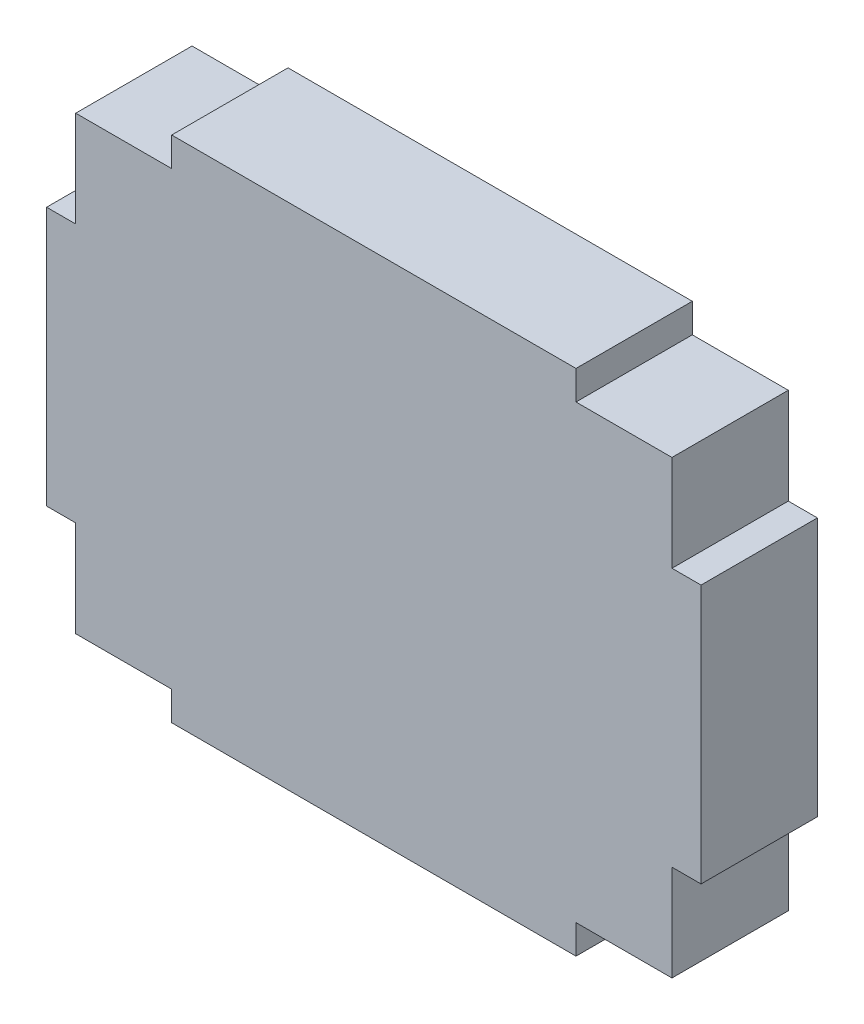
ISO-10303-21;
HEADER;
FILE_DESCRIPTION(('STEP AP214'),'2;1');
FILE_NAME('part.step','',(''),(''),'','','');
FILE_SCHEMA(('AUTOMOTIVE_DESIGN { 1 0 10303 214 1 1 1 1 }'));
ENDSEC;
DATA;
#1=APPLICATION_CONTEXT('core data for automotive mechanical design processes');
#2=APPLICATION_PROTOCOL_DEFINITION('international standard','automotive_design',2000,#1);
#3=PRODUCT_CONTEXT('',#1,'mechanical');
#4=PRODUCT('Part','Part','',(#3));
#5=PRODUCT_RELATED_PRODUCT_CATEGORY('part','',(#4));
#6=PRODUCT_DEFINITION_FORMATION('','',#4);
#7=PRODUCT_DEFINITION_CONTEXT('part definition',#1,'design');
#8=PRODUCT_DEFINITION('design','',#6,#7);
#9=PRODUCT_DEFINITION_SHAPE('','',#8);
#10=(LENGTH_UNIT() NAMED_UNIT(*) SI_UNIT(.MILLI.,.METRE.));
#11=(NAMED_UNIT(*) PLANE_ANGLE_UNIT() SI_UNIT($,.RADIAN.));
#12=(NAMED_UNIT(*) SI_UNIT($,.STERADIAN.) SOLID_ANGLE_UNIT());
#13=UNCERTAINTY_MEASURE_WITH_UNIT(LENGTH_MEASURE(1.E-05),#10,'distance_accuracy_value','');
#14=(GEOMETRIC_REPRESENTATION_CONTEXT(3) GLOBAL_UNCERTAINTY_ASSIGNED_CONTEXT((#13)) GLOBAL_UNIT_ASSIGNED_CONTEXT((#10,
#11,#12)) REPRESENTATION_CONTEXT('',''));
#15=CARTESIAN_POINT('',(0.,0.,0.));
#16=DIRECTION('',(0.,0.,1.));
#17=DIRECTION('',(1.,0.,0.));
#18=AXIS2_PLACEMENT_3D('',#15,#16,#17);
#19=CARTESIAN_POINT('',(0.,0.,0.8));
#20=DIRECTION('',(0.,0.,1.));
#21=DIRECTION('',(1.,0.,0.));
#22=AXIS2_PLACEMENT_3D('',#19,#20,#21);
#23=PLANE('',#22);
#24=DIRECTION('',(0.,1.,0.));
#25=VECTOR('',#24,1.);
#26=CARTESIAN_POINT('',(-1.39,0.,0.8));
#27=LINE('',#26,#25);
#28=CARTESIAN_POINT('',(-1.39,-1.55,0.8));
#29=VERTEX_POINT('',#28);
#30=CARTESIAN_POINT('',(-1.39,-1.75,0.8));
#31=VERTEX_POINT('',#30);
#32=EDGE_CURVE('E190',#29,#31,#27,.F.);
#33=ORIENTED_EDGE('',*,*,#32,.T.);
#34=DIRECTION('',(1.,0.,0.));
#35=VECTOR('',#34,1.);
#36=CARTESIAN_POINT('',(1.11,-1.75,0.8));
#37=LINE('',#36,#35);
#38=CARTESIAN_POINT('',(1.39,-1.75,0.8));
#39=VERTEX_POINT('',#38);
#40=EDGE_CURVE('E192',#39,#31,#37,.F.);
#41=ORIENTED_EDGE('',*,*,#40,.F.);
#42=DIRECTION('',(0.,1.,0.));
#43=VECTOR('',#42,1.);
#44=CARTESIAN_POINT('',(1.39,-1.75,0.8));
#45=LINE('',#44,#43);
#46=CARTESIAN_POINT('',(1.39,-1.55,0.8));
#47=VERTEX_POINT('',#46);
#48=EDGE_CURVE('E194',#47,#39,#45,.F.);
#49=ORIENTED_EDGE('',*,*,#48,.F.);
#50=DIRECTION('',(1.,0.,0.));
#51=VECTOR('',#50,1.);
#52=CARTESIAN_POINT('',(1.39,-1.55,0.8));
#53=LINE('',#52,#51);
#54=CARTESIAN_POINT('',(2.05,-1.55,0.8));
#55=VERTEX_POINT('',#54);
#56=EDGE_CURVE('E199',#55,#47,#53,.F.);
#57=ORIENTED_EDGE('',*,*,#56,.F.);
#58=DIRECTION('',(0.,1.,0.));
#59=VECTOR('',#58,1.);
#60=CARTESIAN_POINT('',(2.05,-1.55,0.8));
#61=LINE('',#60,#59);
#62=CARTESIAN_POINT('',(2.05,-0.89,0.8));
#63=VERTEX_POINT('',#62);
#64=EDGE_CURVE('E203',#63,#55,#61,.F.);
#65=ORIENTED_EDGE('',*,*,#64,.F.);
#66=DIRECTION('',(1.,0.,0.));
#67=VECTOR('',#66,1.);
#68=CARTESIAN_POINT('',(2.05,-0.89,0.8));
#69=LINE('',#68,#67);
#70=CARTESIAN_POINT('',(2.25,-0.89,0.8));
#71=VERTEX_POINT('',#70);
#72=EDGE_CURVE('E207',#71,#63,#69,.F.);
#73=ORIENTED_EDGE('',*,*,#72,.F.);
#74=DIRECTION('',(0.,1.,0.));
#75=VECTOR('',#74,1.);
#76=CARTESIAN_POINT('',(2.25,0.61,0.8));
#77=LINE('',#76,#75);
#78=CARTESIAN_POINT('',(2.25,0.89,0.8));
#79=VERTEX_POINT('',#78);
#80=EDGE_CURVE('E213',#79,#71,#77,.F.);
#81=ORIENTED_EDGE('',*,*,#80,.F.);
#82=DIRECTION('',(1.,0.,0.));
#83=VECTOR('',#82,1.);
#84=CARTESIAN_POINT('',(2.25,0.89,0.8));
#85=LINE('',#84,#83);
#86=CARTESIAN_POINT('',(2.05,0.89,0.8));
#87=VERTEX_POINT('',#86);
#88=EDGE_CURVE('E215',#87,#79,#85,.T.);
#89=ORIENTED_EDGE('',*,*,#88,.F.);
#90=DIRECTION('',(0.,1.,0.));
#91=VECTOR('',#90,1.);
#92=CARTESIAN_POINT('',(2.05,0.89,0.8));
#93=LINE('',#92,#91);
#94=CARTESIAN_POINT('',(2.05,1.55,0.8));
#95=VERTEX_POINT('',#94);
#96=EDGE_CURVE('E220',#95,#87,#93,.F.);
#97=ORIENTED_EDGE('',*,*,#96,.F.);
#98=DIRECTION('',(1.,0.,0.));
#99=VECTOR('',#98,1.);
#100=CARTESIAN_POINT('',(2.05,1.55,0.8));
#101=LINE('',#100,#99);
#102=CARTESIAN_POINT('',(1.39,1.55,0.8));
#103=VERTEX_POINT('',#102);
#104=EDGE_CURVE('E224',#103,#95,#101,.T.);
#105=ORIENTED_EDGE('',*,*,#104,.F.);
#106=DIRECTION('',(0.,1.,0.));
#107=VECTOR('',#106,1.);
#108=CARTESIAN_POINT('',(1.39,1.55,0.8));
#109=LINE('',#108,#107);
#110=CARTESIAN_POINT('',(1.39,1.75,0.8));
#111=VERTEX_POINT('',#110);
#112=EDGE_CURVE('E157',#111,#103,#109,.F.);
#113=ORIENTED_EDGE('',*,*,#112,.F.);
#114=DIRECTION('',(1.,0.,0.));
#115=VECTOR('',#114,1.);
#116=CARTESIAN_POINT('',(1.11,1.75,0.8));
#117=LINE('',#116,#115);
#118=CARTESIAN_POINT('',(-1.39,1.75,0.8));
#119=VERTEX_POINT('',#118);
#120=EDGE_CURVE('E153',#119,#111,#117,.T.);
#121=ORIENTED_EDGE('',*,*,#120,.F.);
#122=DIRECTION('',(0.,1.,0.));
#123=VECTOR('',#122,1.);
#124=CARTESIAN_POINT('',(-1.39,0.,0.8));
#125=LINE('',#124,#123);
#126=CARTESIAN_POINT('',(-1.39,1.55,0.8));
#127=VERTEX_POINT('',#126);
#128=EDGE_CURVE('E20',#119,#127,#125,.F.);
#129=ORIENTED_EDGE('',*,*,#128,.T.);
#130=DIRECTION('',(1.,0.,0.));
#131=VECTOR('',#130,1.);
#132=CARTESIAN_POINT('',(0.,1.55,0.8));
#133=LINE('',#132,#131);
#134=CARTESIAN_POINT('',(-2.05,1.55,0.8));
#135=VERTEX_POINT('',#134);
#136=EDGE_CURVE('E174',#127,#135,#133,.F.);
#137=ORIENTED_EDGE('',*,*,#136,.T.);
#138=DIRECTION('',(0.,1.,0.));
#139=VECTOR('',#138,1.);
#140=CARTESIAN_POINT('',(-2.05,0.,0.8));
#141=LINE('',#140,#139);
#142=CARTESIAN_POINT('',(-2.05,0.89,0.8));
#143=VERTEX_POINT('',#142);
#144=EDGE_CURVE('E175',#135,#143,#141,.F.);
#145=ORIENTED_EDGE('',*,*,#144,.T.);
#146=DIRECTION('',(1.,0.,0.));
#147=VECTOR('',#146,1.);
#148=CARTESIAN_POINT('',(0.,0.89,0.8));
#149=LINE('',#148,#147);
#150=CARTESIAN_POINT('',(-2.25,0.89,0.8));
#151=VERTEX_POINT('',#150);
#152=EDGE_CURVE('E177',#143,#151,#149,.F.);
#153=ORIENTED_EDGE('',*,*,#152,.T.);
#154=DIRECTION('',(0.,1.,0.));
#155=VECTOR('',#154,1.);
#156=CARTESIAN_POINT('',(-2.25,0.,0.8));
#157=LINE('',#156,#155);
#158=CARTESIAN_POINT('',(-2.25,-0.89,0.8));
#159=VERTEX_POINT('',#158);
#160=EDGE_CURVE('E182',#151,#159,#157,.F.);
#161=ORIENTED_EDGE('',*,*,#160,.T.);
#162=DIRECTION('',(1.,0.,0.));
#163=VECTOR('',#162,1.);
#164=CARTESIAN_POINT('',(0.,-0.89,0.8));
#165=LINE('',#164,#163);
#166=CARTESIAN_POINT('',(-2.05,-0.89,0.8));
#167=VERTEX_POINT('',#166);
#168=EDGE_CURVE('E184',#159,#167,#165,.T.);
#169=ORIENTED_EDGE('',*,*,#168,.T.);
#170=DIRECTION('',(0.,1.,0.));
#171=VECTOR('',#170,1.);
#172=CARTESIAN_POINT('',(-2.05,0.,0.8));
#173=LINE('',#172,#171);
#174=CARTESIAN_POINT('',(-2.05,-1.55,0.8));
#175=VERTEX_POINT('',#174);
#176=EDGE_CURVE('E186',#167,#175,#173,.F.);
#177=ORIENTED_EDGE('',*,*,#176,.T.);
#178=DIRECTION('',(1.,0.,0.));
#179=VECTOR('',#178,1.);
#180=CARTESIAN_POINT('',(0.,-1.55,0.8));
#181=LINE('',#180,#179);
#182=EDGE_CURVE('E188',#175,#29,#181,.T.);
#183=ORIENTED_EDGE('',*,*,#182,.T.);
#184=EDGE_LOOP('',(#33,#41,#49,#57,#65,#73,#81,#89,#97,#105,#113,#121,#129,#137,#145,#153,#161,
#169,#177,#183));
#185=FACE_BOUND('',#184,.T.);
#186=ADVANCED_FACE('F17',(#185),#23,.T.);
#187=CARTESIAN_POINT('',(1.11,-1.75,0.));
#188=DIRECTION('',(0.,-1.,0.));
#189=DIRECTION('',(0.,0.,-1.));
#190=AXIS2_PLACEMENT_3D('',#187,#188,#189);
#191=PLANE('',#190);
#192=ORIENTED_EDGE('',*,*,#40,.T.);
#193=DIRECTION('',(0.,0.,1.));
#194=VECTOR('',#193,1.);
#195=CARTESIAN_POINT('',(-1.39,-1.75,0.));
#196=LINE('',#195,#194);
#197=CARTESIAN_POINT('',(-1.39,-1.75,0.));
#198=VERTEX_POINT('',#197);
#199=EDGE_CURVE('E246',#198,#31,#196,.T.);
#200=ORIENTED_EDGE('',*,*,#199,.F.);
#201=DIRECTION('',(1.,0.,0.));
#202=VECTOR('',#201,1.);
#203=CARTESIAN_POINT('',(0.,-1.75,0.));
#204=LINE('',#203,#202);
#205=CARTESIAN_POINT('',(1.39,-1.75,0.));
#206=VERTEX_POINT('',#205);
#207=EDGE_CURVE('E250',#198,#206,#204,.T.);
#208=ORIENTED_EDGE('',*,*,#207,.T.);
#209=DIRECTION('',(0.,0.,-1.));
#210=VECTOR('',#209,1.);
#211=CARTESIAN_POINT('',(1.39,-1.75,0.));
#212=LINE('',#211,#210);
#213=EDGE_CURVE('E196',#39,#206,#212,.T.);
#214=ORIENTED_EDGE('',*,*,#213,.F.);
#215=EDGE_LOOP('',(#192,#200,#208,#214));
#216=FACE_BOUND('',#215,.T.);
#217=ADVANCED_FACE('F506',(#216),#191,.T.);
#218=CARTESIAN_POINT('',(1.39,-1.75,0.));
#219=DIRECTION('',(1.,0.,0.));
#220=DIRECTION('',(0.,0.,-1.));
#221=AXIS2_PLACEMENT_3D('',#218,#219,#220);
#222=PLANE('',#221);
#223=ORIENTED_EDGE('',*,*,#213,.T.);
#224=DIRECTION('',(0.,1.,0.));
#225=VECTOR('',#224,1.);
#226=CARTESIAN_POINT('',(1.39,0.,0.));
#227=LINE('',#226,#225);
#228=CARTESIAN_POINT('',(1.39,-1.55,0.));
#229=VERTEX_POINT('',#228);
#230=EDGE_CURVE('E252',#206,#229,#227,.T.);
#231=ORIENTED_EDGE('',*,*,#230,.T.);
#232=DIRECTION('',(0.,0.,-1.));
#233=VECTOR('',#232,1.);
#234=CARTESIAN_POINT('',(1.39,-1.55,0.));
#235=LINE('',#234,#233);
#236=EDGE_CURVE('E201',#47,#229,#235,.T.);
#237=ORIENTED_EDGE('',*,*,#236,.F.);
#238=ORIENTED_EDGE('',*,*,#48,.T.);
#239=EDGE_LOOP('',(#223,#231,#237,#238));
#240=FACE_BOUND('',#239,.T.);
#241=ADVANCED_FACE('F497',(#240),#222,.T.);
#242=CARTESIAN_POINT('',(1.39,-1.55,0.));
#243=DIRECTION('',(0.,-1.,0.));
#244=DIRECTION('',(0.,0.,-1.));
#245=AXIS2_PLACEMENT_3D('',#242,#243,#244);
#246=PLANE('',#245);
#247=ORIENTED_EDGE('',*,*,#236,.T.);
#248=DIRECTION('',(1.,0.,0.));
#249=VECTOR('',#248,1.);
#250=CARTESIAN_POINT('',(0.,-1.55,0.));
#251=LINE('',#250,#249);
#252=CARTESIAN_POINT('',(2.05,-1.55,0.));
#253=VERTEX_POINT('',#252);
#254=EDGE_CURVE('E255',#229,#253,#251,.T.);
#255=ORIENTED_EDGE('',*,*,#254,.T.);
#256=DIRECTION('',(0.,0.,-1.));
#257=VECTOR('',#256,1.);
#258=CARTESIAN_POINT('',(2.05,-1.55,0.));
#259=LINE('',#258,#257);
#260=EDGE_CURVE('E205',#55,#253,#259,.T.);
#261=ORIENTED_EDGE('',*,*,#260,.F.);
#262=ORIENTED_EDGE('',*,*,#56,.T.);
#263=EDGE_LOOP('',(#247,#255,#261,#262));
#264=FACE_BOUND('',#263,.T.);
#265=ADVANCED_FACE('F488',(#264),#246,.T.);
#266=CARTESIAN_POINT('',(2.05,-1.55,0.));
#267=DIRECTION('',(1.,0.,0.));
#268=DIRECTION('',(0.,0.,-1.));
#269=AXIS2_PLACEMENT_3D('',#266,#267,#268);
#270=PLANE('',#269);
#271=ORIENTED_EDGE('',*,*,#260,.T.);
#272=DIRECTION('',(0.,1.,0.));
#273=VECTOR('',#272,1.);
#274=CARTESIAN_POINT('',(2.05,0.,0.));
#275=LINE('',#274,#273);
#276=CARTESIAN_POINT('',(2.05,-0.89,0.));
#277=VERTEX_POINT('',#276);
#278=EDGE_CURVE('E258',#253,#277,#275,.T.);
#279=ORIENTED_EDGE('',*,*,#278,.T.);
#280=DIRECTION('',(0.,0.,-1.));
#281=VECTOR('',#280,1.);
#282=CARTESIAN_POINT('',(2.05,-0.89,0.));
#283=LINE('',#282,#281);
#284=EDGE_CURVE('E209',#63,#277,#283,.T.);
#285=ORIENTED_EDGE('',*,*,#284,.F.);
#286=ORIENTED_EDGE('',*,*,#64,.T.);
#287=EDGE_LOOP('',(#271,#279,#285,#286));
#288=FACE_BOUND('',#287,.T.);
#289=ADVANCED_FACE('F479',(#288),#270,.T.);
#290=CARTESIAN_POINT('',(2.05,-0.89,0.));
#291=DIRECTION('',(0.,-1.,0.));
#292=DIRECTION('',(0.,0.,-1.));
#293=AXIS2_PLACEMENT_3D('',#290,#291,#292);
#294=PLANE('',#293);
#295=ORIENTED_EDGE('',*,*,#284,.T.);
#296=DIRECTION('',(1.,0.,0.));
#297=VECTOR('',#296,1.);
#298=CARTESIAN_POINT('',(0.,-0.89,0.));
#299=LINE('',#298,#297);
#300=CARTESIAN_POINT('',(2.25,-0.89,0.));
#301=VERTEX_POINT('',#300);
#302=EDGE_CURVE('E261',#277,#301,#299,.T.);
#303=ORIENTED_EDGE('',*,*,#302,.T.);
#304=DIRECTION('',(0.,0.,-1.));
#305=VECTOR('',#304,1.);
#306=CARTESIAN_POINT('',(2.25,-0.89,0.));
#307=LINE('',#306,#305);
#308=EDGE_CURVE('E211',#71,#301,#307,.T.);
#309=ORIENTED_EDGE('',*,*,#308,.F.);
#310=ORIENTED_EDGE('',*,*,#72,.T.);
#311=EDGE_LOOP('',(#295,#303,#309,#310));
#312=FACE_BOUND('',#311,.T.);
#313=ADVANCED_FACE('F470',(#312),#294,.T.);
#314=CARTESIAN_POINT('',(2.25,0.61,0.));
#315=DIRECTION('',(1.,0.,0.));
#316=DIRECTION('',(0.,0.,-1.));
#317=AXIS2_PLACEMENT_3D('',#314,#315,#316);
#318=PLANE('',#317);
#319=ORIENTED_EDGE('',*,*,#80,.T.);
#320=ORIENTED_EDGE('',*,*,#308,.T.);
#321=DIRECTION('',(0.,1.,0.));
#322=VECTOR('',#321,1.);
#323=CARTESIAN_POINT('',(2.25,0.,0.));
#324=LINE('',#323,#322);
#325=CARTESIAN_POINT('',(2.25,0.89,0.));
#326=VERTEX_POINT('',#325);
#327=EDGE_CURVE('E264',#301,#326,#324,.T.);
#328=ORIENTED_EDGE('',*,*,#327,.T.);
#329=DIRECTION('',(0.,0.,1.));
#330=VECTOR('',#329,1.);
#331=CARTESIAN_POINT('',(2.25,0.89,0.));
#332=LINE('',#331,#330);
#333=EDGE_CURVE('E217',#79,#326,#332,.F.);
#334=ORIENTED_EDGE('',*,*,#333,.F.);
#335=EDGE_LOOP('',(#319,#320,#328,#334));
#336=FACE_BOUND('',#335,.T.);
#337=ADVANCED_FACE('F461',(#336),#318,.T.);
#338=CARTESIAN_POINT('',(2.25,0.89,0.));
#339=DIRECTION('',(0.,1.,0.));
#340=DIRECTION('',(0.,0.,1.));
#341=AXIS2_PLACEMENT_3D('',#338,#339,#340);
#342=PLANE('',#341);
#343=ORIENTED_EDGE('',*,*,#333,.T.);
#344=DIRECTION('',(1.,0.,0.));
#345=VECTOR('',#344,1.);
#346=CARTESIAN_POINT('',(0.,0.89,0.));
#347=LINE('',#346,#345);
#348=CARTESIAN_POINT('',(2.05,0.89,0.));
#349=VERTEX_POINT('',#348);
#350=EDGE_CURVE('E266',#326,#349,#347,.F.);
#351=ORIENTED_EDGE('',*,*,#350,.T.);
#352=DIRECTION('',(0.,0.,-1.));
#353=VECTOR('',#352,1.);
#354=CARTESIAN_POINT('',(2.05,0.89,0.));
#355=LINE('',#354,#353);
#356=EDGE_CURVE('E222',#87,#349,#355,.T.);
#357=ORIENTED_EDGE('',*,*,#356,.F.);
#358=ORIENTED_EDGE('',*,*,#88,.T.);
#359=EDGE_LOOP('',(#343,#351,#357,#358));
#360=FACE_BOUND('',#359,.T.);
#361=ADVANCED_FACE('F452',(#360),#342,.T.);
#362=CARTESIAN_POINT('',(2.05,0.89,0.));
#363=DIRECTION('',(1.,0.,0.));
#364=DIRECTION('',(0.,0.,-1.));
#365=AXIS2_PLACEMENT_3D('',#362,#363,#364);
#366=PLANE('',#365);
#367=ORIENTED_EDGE('',*,*,#356,.T.);
#368=DIRECTION('',(0.,1.,0.));
#369=VECTOR('',#368,1.);
#370=CARTESIAN_POINT('',(2.05,0.,0.));
#371=LINE('',#370,#369);
#372=CARTESIAN_POINT('',(2.05,1.55,0.));
#373=VERTEX_POINT('',#372);
#374=EDGE_CURVE('E269',#349,#373,#371,.T.);
#375=ORIENTED_EDGE('',*,*,#374,.T.);
#376=DIRECTION('',(0.,0.,1.));
#377=VECTOR('',#376,1.);
#378=CARTESIAN_POINT('',(2.05,1.55,0.));
#379=LINE('',#378,#377);
#380=EDGE_CURVE('E226',#95,#373,#379,.F.);
#381=ORIENTED_EDGE('',*,*,#380,.F.);
#382=ORIENTED_EDGE('',*,*,#96,.T.);
#383=EDGE_LOOP('',(#367,#375,#381,#382));
#384=FACE_BOUND('',#383,.T.);
#385=ADVANCED_FACE('F443',(#384),#366,.T.);
#386=CARTESIAN_POINT('',(2.05,1.55,0.));
#387=DIRECTION('',(0.,1.,0.));
#388=DIRECTION('',(0.,0.,1.));
#389=AXIS2_PLACEMENT_3D('',#386,#387,#388);
#390=PLANE('',#389);
#391=ORIENTED_EDGE('',*,*,#380,.T.);
#392=DIRECTION('',(1.,0.,0.));
#393=VECTOR('',#392,1.);
#394=CARTESIAN_POINT('',(0.,1.55,0.));
#395=LINE('',#394,#393);
#396=CARTESIAN_POINT('',(1.39,1.55,0.));
#397=VERTEX_POINT('',#396);
#398=EDGE_CURVE('E272',#373,#397,#395,.F.);
#399=ORIENTED_EDGE('',*,*,#398,.T.);
#400=DIRECTION('',(0.,0.,-1.));
#401=VECTOR('',#400,1.);
#402=CARTESIAN_POINT('',(1.39,1.55,0.));
#403=LINE('',#402,#401);
#404=EDGE_CURVE('E229',#103,#397,#403,.T.);
#405=ORIENTED_EDGE('',*,*,#404,.F.);
#406=ORIENTED_EDGE('',*,*,#104,.T.);
#407=EDGE_LOOP('',(#391,#399,#405,#406));
#408=FACE_BOUND('',#407,.T.);
#409=ADVANCED_FACE('F434',(#408),#390,.T.);
#410=CARTESIAN_POINT('',(1.39,1.55,0.));
#411=DIRECTION('',(1.,0.,0.));
#412=DIRECTION('',(0.,0.,-1.));
#413=AXIS2_PLACEMENT_3D('',#410,#411,#412);
#414=PLANE('',#413);
#415=ORIENTED_EDGE('',*,*,#404,.T.);
#416=DIRECTION('',(0.,1.,0.));
#417=VECTOR('',#416,1.);
#418=CARTESIAN_POINT('',(1.39,0.,0.));
#419=LINE('',#418,#417);
#420=CARTESIAN_POINT('',(1.39,1.75,0.));
#421=VERTEX_POINT('',#420);
#422=EDGE_CURVE('E275',#397,#421,#419,.T.);
#423=ORIENTED_EDGE('',*,*,#422,.T.);
#424=DIRECTION('',(0.,0.,1.));
#425=VECTOR('',#424,1.);
#426=CARTESIAN_POINT('',(1.39,1.75,0.));
#427=LINE('',#426,#425);
#428=EDGE_CURVE('E161',#111,#421,#427,.F.);
#429=ORIENTED_EDGE('',*,*,#428,.F.);
#430=ORIENTED_EDGE('',*,*,#112,.T.);
#431=EDGE_LOOP('',(#415,#423,#429,#430));
#432=FACE_BOUND('',#431,.T.);
#433=ADVANCED_FACE('F426',(#432),#414,.T.);
#434=CARTESIAN_POINT('',(-1.11,1.75,0.));
#435=DIRECTION('',(0.,1.,0.));
#436=DIRECTION('',(0.,0.,1.));
#437=AXIS2_PLACEMENT_3D('',#434,#435,#436);
#438=PLANE('',#437);
#439=DIRECTION('',(0.,0.,1.));
#440=VECTOR('',#439,1.);
#441=CARTESIAN_POINT('',(-1.39,1.75,0.));
#442=LINE('',#441,#440);
#443=CARTESIAN_POINT('',(-1.39,1.75,0.));
#444=VERTEX_POINT('',#443);
#445=EDGE_CURVE('E160',#119,#444,#442,.F.);
#446=ORIENTED_EDGE('',*,*,#445,.F.);
#447=ORIENTED_EDGE('',*,*,#120,.T.);
#448=ORIENTED_EDGE('',*,*,#428,.T.);
#449=DIRECTION('',(1.,0.,0.));
#450=VECTOR('',#449,1.);
#451=CARTESIAN_POINT('',(0.,1.75,0.));
#452=LINE('',#451,#450);
#453=EDGE_CURVE('E166',#421,#444,#452,.F.);
#454=ORIENTED_EDGE('',*,*,#453,.T.);
#455=EDGE_LOOP('',(#446,#447,#448,#454));
#456=FACE_BOUND('',#455,.T.);
#457=ADVANCED_FACE('F164',(#456),#438,.T.);
#458=CARTESIAN_POINT('',(-1.39,1.75,0.));
#459=DIRECTION('',(-1.,0.,0.));
#460=DIRECTION('',(0.,0.,1.));
#461=AXIS2_PLACEMENT_3D('',#458,#459,#460);
#462=PLANE('',#461);
#463=ORIENTED_EDGE('',*,*,#445,.T.);
#464=DIRECTION('',(0.,1.,0.));
#465=VECTOR('',#464,1.);
#466=CARTESIAN_POINT('',(-1.39,0.,0.));
#467=LINE('',#466,#465);
#468=CARTESIAN_POINT('',(-1.39,1.55,0.));
#469=VERTEX_POINT('',#468);
#470=EDGE_CURVE('E279',#444,#469,#467,.F.);
#471=ORIENTED_EDGE('',*,*,#470,.T.);
#472=DIRECTION('',(0.,0.,1.));
#473=VECTOR('',#472,1.);
#474=CARTESIAN_POINT('',(-1.39,1.55,0.));
#475=LINE('',#474,#473);
#476=EDGE_CURVE('E170',#127,#469,#475,.F.);
#477=ORIENTED_EDGE('',*,*,#476,.F.);
#478=ORIENTED_EDGE('',*,*,#128,.F.);
#479=EDGE_LOOP('',(#463,#471,#477,#478));
#480=FACE_BOUND('',#479,.T.);
#481=ADVANCED_FACE('F172',(#480),#462,.T.);
#482=CARTESIAN_POINT('',(-1.39,1.55,0.));
#483=DIRECTION('',(0.,1.,0.));
#484=DIRECTION('',(0.,0.,1.));
#485=AXIS2_PLACEMENT_3D('',#482,#483,#484);
#486=PLANE('',#485);
#487=ORIENTED_EDGE('',*,*,#476,.T.);
#488=DIRECTION('',(1.,0.,0.));
#489=VECTOR('',#488,1.);
#490=CARTESIAN_POINT('',(0.,1.55,0.));
#491=LINE('',#490,#489);
#492=CARTESIAN_POINT('',(-2.05,1.55,0.));
#493=VERTEX_POINT('',#492);
#494=EDGE_CURVE('E281',#469,#493,#491,.F.);
#495=ORIENTED_EDGE('',*,*,#494,.T.);
#496=DIRECTION('',(0.,0.,1.));
#497=VECTOR('',#496,1.);
#498=CARTESIAN_POINT('',(-2.05,1.55,0.));
#499=LINE('',#498,#497);
#500=EDGE_CURVE('E233',#135,#493,#499,.F.);
#501=ORIENTED_EDGE('',*,*,#500,.F.);
#502=ORIENTED_EDGE('',*,*,#136,.F.);
#503=EDGE_LOOP('',(#487,#495,#501,#502));
#504=FACE_BOUND('',#503,.T.);
#505=ADVANCED_FACE('F330',(#504),#486,.T.);
#506=CARTESIAN_POINT('',(-2.05,1.55,0.));
#507=DIRECTION('',(-1.,0.,0.));
#508=DIRECTION('',(0.,0.,1.));
#509=AXIS2_PLACEMENT_3D('',#506,#507,#508);
#510=PLANE('',#509);
#511=ORIENTED_EDGE('',*,*,#500,.T.);
#512=DIRECTION('',(0.,1.,0.));
#513=VECTOR('',#512,1.);
#514=CARTESIAN_POINT('',(-2.05,0.,0.));
#515=LINE('',#514,#513);
#516=CARTESIAN_POINT('',(-2.05,0.89,0.));
#517=VERTEX_POINT('',#516);
#518=EDGE_CURVE('E284',#493,#517,#515,.F.);
#519=ORIENTED_EDGE('',*,*,#518,.T.);
#520=DIRECTION('',(0.,0.,1.));
#521=VECTOR('',#520,1.);
#522=CARTESIAN_POINT('',(-2.05,0.89,0.));
#523=LINE('',#522,#521);
#524=EDGE_CURVE('E235',#143,#517,#523,.F.);
#525=ORIENTED_EDGE('',*,*,#524,.F.);
#526=ORIENTED_EDGE('',*,*,#144,.F.);
#527=EDGE_LOOP('',(#511,#519,#525,#526));
#528=FACE_BOUND('',#527,.T.);
#529=ADVANCED_FACE('F327',(#528),#510,.T.);
#530=CARTESIAN_POINT('',(-2.05,0.89,0.));
#531=DIRECTION('',(0.,1.,0.));
#532=DIRECTION('',(0.,0.,1.));
#533=AXIS2_PLACEMENT_3D('',#530,#531,#532);
#534=PLANE('',#533);
#535=ORIENTED_EDGE('',*,*,#524,.T.);
#536=DIRECTION('',(1.,0.,0.));
#537=VECTOR('',#536,1.);
#538=CARTESIAN_POINT('',(0.,0.89,0.));
#539=LINE('',#538,#537);
#540=CARTESIAN_POINT('',(-2.25,0.89,0.));
#541=VERTEX_POINT('',#540);
#542=EDGE_CURVE('E287',#517,#541,#539,.F.);
#543=ORIENTED_EDGE('',*,*,#542,.T.);
#544=DIRECTION('',(0.,0.,1.));
#545=VECTOR('',#544,1.);
#546=CARTESIAN_POINT('',(-2.25,0.89,0.));
#547=LINE('',#546,#545);
#548=EDGE_CURVE('E237',#151,#541,#547,.F.);
#549=ORIENTED_EDGE('',*,*,#548,.F.);
#550=ORIENTED_EDGE('',*,*,#152,.F.);
#551=EDGE_LOOP('',(#535,#543,#549,#550));
#552=FACE_BOUND('',#551,.T.);
#553=ADVANCED_FACE('F322',(#552),#534,.T.);
#554=CARTESIAN_POINT('',(-2.25,-0.61,0.));
#555=DIRECTION('',(-1.,0.,0.));
#556=DIRECTION('',(0.,0.,1.));
#557=AXIS2_PLACEMENT_3D('',#554,#555,#556);
#558=PLANE('',#557);
#559=ORIENTED_EDGE('',*,*,#160,.F.);
#560=ORIENTED_EDGE('',*,*,#548,.T.);
#561=DIRECTION('',(0.,1.,0.));
#562=VECTOR('',#561,1.);
#563=CARTESIAN_POINT('',(-2.25,0.,0.));
#564=LINE('',#563,#562);
#565=CARTESIAN_POINT('',(-2.25,-0.89,0.));
#566=VERTEX_POINT('',#565);
#567=EDGE_CURVE('E290',#541,#566,#564,.F.);
#568=ORIENTED_EDGE('',*,*,#567,.T.);
#569=DIRECTION('',(0.,0.,-1.));
#570=VECTOR('',#569,1.);
#571=CARTESIAN_POINT('',(-2.25,-0.89,0.));
#572=LINE('',#571,#570);
#573=EDGE_CURVE('E239',#159,#566,#572,.T.);
#574=ORIENTED_EDGE('',*,*,#573,.F.);
#575=EDGE_LOOP('',(#559,#560,#568,#574));
#576=FACE_BOUND('',#575,.T.);
#577=ADVANCED_FACE('F354',(#576),#558,.T.);
#578=CARTESIAN_POINT('',(-2.25,-0.89,0.));
#579=DIRECTION('',(0.,-1.,0.));
#580=DIRECTION('',(0.,0.,-1.));
#581=AXIS2_PLACEMENT_3D('',#578,#579,#580);
#582=PLANE('',#581);
#583=ORIENTED_EDGE('',*,*,#573,.T.);
#584=DIRECTION('',(1.,0.,0.));
#585=VECTOR('',#584,1.);
#586=CARTESIAN_POINT('',(0.,-0.89,0.));
#587=LINE('',#586,#585);
#588=CARTESIAN_POINT('',(-2.05,-0.89,0.));
#589=VERTEX_POINT('',#588);
#590=EDGE_CURVE('E292',#566,#589,#587,.T.);
#591=ORIENTED_EDGE('',*,*,#590,.T.);
#592=DIRECTION('',(0.,0.,1.));
#593=VECTOR('',#592,1.);
#594=CARTESIAN_POINT('',(-2.05,-0.89,0.));
#595=LINE('',#594,#593);
#596=EDGE_CURVE('E242',#167,#589,#595,.F.);
#597=ORIENTED_EDGE('',*,*,#596,.F.);
#598=ORIENTED_EDGE('',*,*,#168,.F.);
#599=EDGE_LOOP('',(#583,#591,#597,#598));
#600=FACE_BOUND('',#599,.T.);
#601=ADVANCED_FACE('F314',(#600),#582,.T.);
#602=CARTESIAN_POINT('',(-2.05,-0.89,0.));
#603=DIRECTION('',(-1.,0.,0.));
#604=DIRECTION('',(0.,0.,1.));
#605=AXIS2_PLACEMENT_3D('',#602,#603,#604);
#606=PLANE('',#605);
#607=ORIENTED_EDGE('',*,*,#596,.T.);
#608=DIRECTION('',(0.,1.,0.));
#609=VECTOR('',#608,1.);
#610=CARTESIAN_POINT('',(-2.05,0.,0.));
#611=LINE('',#610,#609);
#612=CARTESIAN_POINT('',(-2.05,-1.55,0.));
#613=VERTEX_POINT('',#612);
#614=EDGE_CURVE('E295',#589,#613,#611,.F.);
#615=ORIENTED_EDGE('',*,*,#614,.T.);
#616=DIRECTION('',(0.,0.,-1.));
#617=VECTOR('',#616,1.);
#618=CARTESIAN_POINT('',(-2.05,-1.55,0.));
#619=LINE('',#618,#617);
#620=EDGE_CURVE('E244',#175,#613,#619,.T.);
#621=ORIENTED_EDGE('',*,*,#620,.F.);
#622=ORIENTED_EDGE('',*,*,#176,.F.);
#623=EDGE_LOOP('',(#607,#615,#621,#622));
#624=FACE_BOUND('',#623,.T.);
#625=ADVANCED_FACE('F309',(#624),#606,.T.);
#626=CARTESIAN_POINT('',(-2.05,-1.55,0.));
#627=DIRECTION('',(0.,-1.,0.));
#628=DIRECTION('',(0.,0.,-1.));
#629=AXIS2_PLACEMENT_3D('',#626,#627,#628);
#630=PLANE('',#629);
#631=ORIENTED_EDGE('',*,*,#620,.T.);
#632=DIRECTION('',(1.,0.,0.));
#633=VECTOR('',#632,1.);
#634=CARTESIAN_POINT('',(0.,-1.55,0.));
#635=LINE('',#634,#633);
#636=CARTESIAN_POINT('',(-1.39,-1.55,0.));
#637=VERTEX_POINT('',#636);
#638=EDGE_CURVE('E26',#613,#637,#635,.T.);
#639=ORIENTED_EDGE('',*,*,#638,.T.);
#640=DIRECTION('',(0.,0.,1.));
#641=VECTOR('',#640,1.);
#642=CARTESIAN_POINT('',(-1.39,-1.55,0.));
#643=LINE('',#642,#641);
#644=EDGE_CURVE('E34',#29,#637,#643,.F.);
#645=ORIENTED_EDGE('',*,*,#644,.F.);
#646=ORIENTED_EDGE('',*,*,#182,.F.);
#647=EDGE_LOOP('',(#631,#639,#645,#646));
#648=FACE_BOUND('',#647,.T.);
#649=ADVANCED_FACE('F301',(#648),#630,.T.);
#650=CARTESIAN_POINT('',(-1.39,-1.55,0.));
#651=DIRECTION('',(-1.,0.,0.));
#652=DIRECTION('',(0.,0.,1.));
#653=AXIS2_PLACEMENT_3D('',#650,#651,#652);
#654=PLANE('',#653);
#655=ORIENTED_EDGE('',*,*,#644,.T.);
#656=DIRECTION('',(0.,1.,0.));
#657=VECTOR('',#656,1.);
#658=CARTESIAN_POINT('',(-1.39,0.,0.));
#659=LINE('',#658,#657);
#660=EDGE_CURVE('E11',#637,#198,#659,.F.);
#661=ORIENTED_EDGE('',*,*,#660,.T.);
#662=ORIENTED_EDGE('',*,*,#199,.T.);
#663=ORIENTED_EDGE('',*,*,#32,.F.);
#664=EDGE_LOOP('',(#655,#661,#662,#663));
#665=FACE_BOUND('',#664,.T.);
#666=ADVANCED_FACE('F341',(#665),#654,.T.);
#667=CARTESIAN_POINT('',(0.,0.,0.));
#668=DIRECTION('',(0.,0.,1.));
#669=DIRECTION('',(1.,0.,0.));
#670=AXIS2_PLACEMENT_3D('',#667,#668,#669);
#671=PLANE('',#670);
#672=ORIENTED_EDGE('',*,*,#638,.F.);
#673=ORIENTED_EDGE('',*,*,#614,.F.);
#674=ORIENTED_EDGE('',*,*,#590,.F.);
#675=ORIENTED_EDGE('',*,*,#567,.F.);
#676=ORIENTED_EDGE('',*,*,#542,.F.);
#677=ORIENTED_EDGE('',*,*,#518,.F.);
#678=ORIENTED_EDGE('',*,*,#494,.F.);
#679=ORIENTED_EDGE('',*,*,#470,.F.);
#680=ORIENTED_EDGE('',*,*,#453,.F.);
#681=ORIENTED_EDGE('',*,*,#422,.F.);
#682=ORIENTED_EDGE('',*,*,#398,.F.);
#683=ORIENTED_EDGE('',*,*,#374,.F.);
#684=ORIENTED_EDGE('',*,*,#350,.F.);
#685=ORIENTED_EDGE('',*,*,#327,.F.);
#686=ORIENTED_EDGE('',*,*,#302,.F.);
#687=ORIENTED_EDGE('',*,*,#278,.F.);
#688=ORIENTED_EDGE('',*,*,#254,.F.);
#689=ORIENTED_EDGE('',*,*,#230,.F.);
#690=ORIENTED_EDGE('',*,*,#207,.F.);
#691=ORIENTED_EDGE('',*,*,#660,.F.);
#692=EDGE_LOOP('',(#672,#673,#674,#675,#676,#677,#678,#679,#680,#681,#682,#683,#684,#685,#686,
#687,#688,#689,#690,#691));
#693=FACE_BOUND('',#692,.T.);
#694=ADVANCED_FACE('F306',(#693),#671,.F.);
#695=CLOSED_SHELL('',(#186,#217,#241,#265,#289,#313,#337,#361,#385,#409,#433,#457,#481,#505,
#529,#553,#577,#601,#625,#649,#666,#694));
#696=MANIFOLD_SOLID_BREP('B1',#695);
#697=ADVANCED_BREP_SHAPE_REPRESENTATION('',(#18,#696),#14);
#698=SHAPE_DEFINITION_REPRESENTATION(#9,#697);
ENDSEC;
END-ISO-10303-21;
